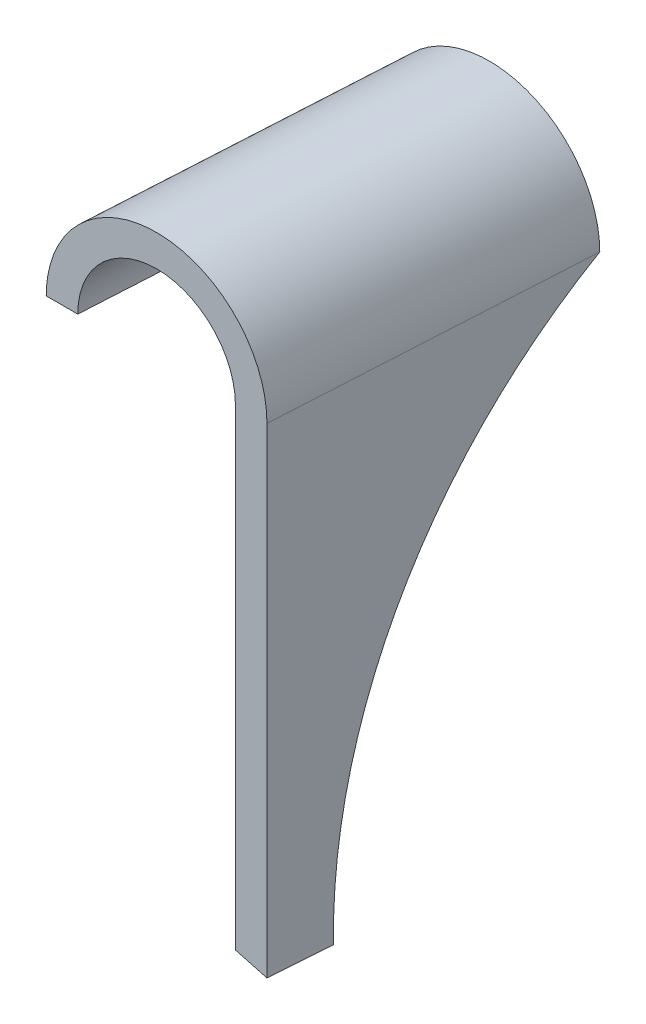
ISO-10303-21;
HEADER;
FILE_DESCRIPTION(('STEP AP214'),'2;1');
FILE_NAME('part.step','',(''),(''),'','','');
FILE_SCHEMA(('AUTOMOTIVE_DESIGN { 1 0 10303 214 1 1 1 1 }'));
ENDSEC;
DATA;
#1=APPLICATION_CONTEXT('core data for automotive mechanical design processes');
#2=APPLICATION_PROTOCOL_DEFINITION('international standard','automotive_design',2000,#1);
#3=PRODUCT_CONTEXT('',#1,'mechanical');
#4=PRODUCT('Part','Part','',(#3));
#5=PRODUCT_RELATED_PRODUCT_CATEGORY('part','',(#4));
#6=PRODUCT_DEFINITION_FORMATION('','',#4);
#7=PRODUCT_DEFINITION_CONTEXT('part definition',#1,'design');
#8=PRODUCT_DEFINITION('design','',#6,#7);
#9=PRODUCT_DEFINITION_SHAPE('','',#8);
#10=(LENGTH_UNIT() NAMED_UNIT(*) SI_UNIT(.MILLI.,.METRE.));
#11=(NAMED_UNIT(*) PLANE_ANGLE_UNIT() SI_UNIT($,.RADIAN.));
#12=(NAMED_UNIT(*) SI_UNIT($,.STERADIAN.) SOLID_ANGLE_UNIT());
#13=UNCERTAINTY_MEASURE_WITH_UNIT(LENGTH_MEASURE(1.E-05),#10,'distance_accuracy_value','');
#14=(GEOMETRIC_REPRESENTATION_CONTEXT(3) GLOBAL_UNCERTAINTY_ASSIGNED_CONTEXT((#13)) GLOBAL_UNIT_ASSIGNED_CONTEXT((#10,
#11,#12)) REPRESENTATION_CONTEXT('',''));
#15=CARTESIAN_POINT('',(0.,0.,0.));
#16=DIRECTION('',(0.,0.,1.));
#17=DIRECTION('',(1.,0.,0.));
#18=AXIS2_PLACEMENT_3D('',#15,#16,#17);
#19=CARTESIAN_POINT('',(0.,0.,10.));
#20=DIRECTION('',(0.,0.,1.));
#21=DIRECTION('',(1.,0.,0.));
#22=AXIS2_PLACEMENT_3D('',#19,#20,#21);
#23=PLANE('',#22);
#24=DIRECTION('',(0.,-1.,0.));
#25=VECTOR('',#24,1.);
#26=CARTESIAN_POINT('',(-114.770321228191,0.,10.));
#27=LINE('',#26,#25);
#28=CARTESIAN_POINT('',(-114.770321228191,64.2083159442407,10.));
#29=VERTEX_POINT('',#28);
#30=CARTESIAN_POINT('',(-114.770321228191,-12.0791229983124,10.));
#31=VERTEX_POINT('',#30);
#32=EDGE_CURVE('E139',#29,#31,#27,.T.);
#33=ORIENTED_EDGE('',*,*,#32,.F.);
#34=CARTESIAN_POINT('',(-132.298860842031,64.2083159442407,10.));
#35=DIRECTION('',(0.,0.,1.));
#36=DIRECTION('',(-1.,0.,0.));
#37=AXIS2_PLACEMENT_3D('',#34,#35,#36);
#38=ELLIPSE('',#37,17.5285396138397,17.5);
#39=CARTESIAN_POINT('',(-149.827400455871,64.2083159442407,9.99999999999999));
#40=VERTEX_POINT('',#39);
#41=EDGE_CURVE('E149',#29,#40,#38,.T.);
#42=ORIENTED_EDGE('',*,*,#41,.T.);
#43=DIRECTION('',(1.,0.,0.));
#44=VECTOR('',#43,1.);
#45=CARTESIAN_POINT('',(-165.74301662356,64.2083159442407,10.));
#46=LINE('',#45,#44);
#47=CARTESIAN_POINT('',(-144.819246280488,64.2083159442407,9.99999999999999));
#48=VERTEX_POINT('',#47);
#49=EDGE_CURVE('E155',#40,#48,#46,.T.);
#50=ORIENTED_EDGE('',*,*,#49,.T.);
#51=CARTESIAN_POINT('',(-132.298860842031,64.2083159442407,10.));
#52=DIRECTION('',(0.,0.,1.));
#53=DIRECTION('',(-1.,0.,0.));
#54=AXIS2_PLACEMENT_3D('',#51,#52,#53);
#55=ELLIPSE('',#54,12.5203854384569,12.5);
#56=CARTESIAN_POINT('',(-119.778475403574,64.2083159442407,9.99999999999976));
#57=VERTEX_POINT('',#56);
#58=EDGE_CURVE('E144',#57,#48,#55,.T.);
#59=ORIENTED_EDGE('',*,*,#58,.F.);
#60=DIRECTION('',(0.,1.,0.));
#61=VECTOR('',#60,1.);
#62=CARTESIAN_POINT('',(-119.778475403574,0.,10.));
#63=LINE('',#62,#61);
#64=CARTESIAN_POINT('',(-119.778475403574,-10.737192131448,9.99999999999976));
#65=VERTEX_POINT('',#64);
#66=EDGE_CURVE('E162',#65,#57,#63,.T.);
#67=ORIENTED_EDGE('',*,*,#66,.F.);
#68=DIRECTION('',(-0.965925826289068,0.258819045102521,0.));
#69=VECTOR('',#68,1.);
#70=CARTESIAN_POINT('',(-10.7079344716167,-39.9625554921918,10.));
#71=LINE('',#70,#69);
#72=EDGE_CURVE('E93',#31,#65,#71,.T.);
#73=ORIENTED_EDGE('',*,*,#72,.F.);
#74=EDGE_LOOP('',(#33,#42,#50,#59,#67,#73));
#75=FACE_BOUND('',#74,.T.);
#76=ADVANCED_FACE('F85',(#75),#23,.T.);
#77=CARTESIAN_POINT('',(-165.74301662356,64.2083159442407,-40.));
#78=DIRECTION('',(0.,-1.,0.));
#79=DIRECTION('',(0.,0.,-1.));
#80=AXIS2_PLACEMENT_3D('',#77,#78,#79);
#81=PLANE('',#80);
#82=DIRECTION('',(-0.0570412885398924,0.,0.99837182021615));
#83=VECTOR('',#82,1.);
#84=CARTESIAN_POINT('',(-141.500625900315,64.2083159442407,-48.0845411169636));
#85=LINE('',#84,#83);
#86=CARTESIAN_POINT('',(-141.962530606785,64.2083159442407,-40.));
#87=VERTEX_POINT('',#86);
#88=EDGE_CURVE('E185',#87,#48,#85,.T.);
#89=ORIENTED_EDGE('',*,*,#88,.T.);
#90=ORIENTED_EDGE('',*,*,#49,.F.);
#91=DIRECTION('',(-0.0570412885398924,0.,0.99837182021615));
#92=VECTOR('',#91,1.);
#93=CARTESIAN_POINT('',(-146.492485001395,64.2083159442407,-48.369747559663));
#94=LINE('',#93,#92);
#95=CARTESIAN_POINT('',(-146.970684782168,64.2083159442407,-40.));
#96=VERTEX_POINT('',#95);
#97=EDGE_CURVE('E104',#96,#40,#94,.T.);
#98=ORIENTED_EDGE('',*,*,#97,.F.);
#99=DIRECTION('',(1.,0.,0.));
#100=VECTOR('',#99,1.);
#101=CARTESIAN_POINT('',(-165.74301662356,64.2083159442407,-40.));
#102=LINE('',#101,#100);
#103=EDGE_CURVE('E157',#96,#87,#102,.T.);
#104=ORIENTED_EDGE('',*,*,#103,.T.);
#105=EDGE_LOOP('',(#89,#90,#98,#104));
#106=FACE_BOUND('',#105,.T.);
#107=ADVANCED_FACE('F205',(#106),#81,.T.);
#108=CARTESIAN_POINT('',(0.,0.,-40.));
#109=DIRECTION('',(0.,0.,1.));
#110=DIRECTION('',(1.,0.,0.));
#111=AXIS2_PLACEMENT_3D('',#108,#109,#110);
#112=PLANE('',#111);
#113=CARTESIAN_POINT('',(-129.442145168328,64.2083159442407,-40.));
#114=DIRECTION('',(0.,0.,1.));
#115=DIRECTION('',(-1.,0.,0.));
#116=AXIS2_PLACEMENT_3D('',#113,#114,#115);
#117=ELLIPSE('',#116,17.5285396138397,17.5);
#118=CARTESIAN_POINT('',(-111.913605554488,64.2083159442407,-40.));
#119=VERTEX_POINT('',#118);
#120=EDGE_CURVE('E12',#119,#96,#117,.T.);
#121=ORIENTED_EDGE('',*,*,#120,.F.);
#122=CARTESIAN_POINT('',(763.265329820694,-10.6773328411647,-40.));
#123=DIRECTION('',(0.,0.,1.));
#124=DIRECTION('',(1.,0.,0.));
#125=AXIS2_PLACEMENT_3D('',#122,#123,#124);
#126=ELLIPSE('',#125,1577.80446942494,90.);
#127=CARTESIAN_POINT('',(-116.921759729871,64.017088464631,-40.));
#128=VERTEX_POINT('',#127);
#129=EDGE_CURVE('E191',#119,#128,#126,.T.);
#130=ORIENTED_EDGE('',*,*,#129,.T.);
#131=DIRECTION('',(0.,1.,0.));
#132=VECTOR('',#131,1.);
#133=CARTESIAN_POINT('',(-116.921759729871,-53.2440936926434,-40.));
#134=LINE('',#133,#132);
#135=CARTESIAN_POINT('',(-116.921759729871,64.2083159442407,-40.));
#136=VERTEX_POINT('',#135);
#137=EDGE_CURVE('E178',#128,#136,#134,.T.);
#138=ORIENTED_EDGE('',*,*,#137,.T.);
#139=CARTESIAN_POINT('',(-129.442145168328,64.2083159442407,-40.));
#140=DIRECTION('',(0.,0.,1.));
#141=DIRECTION('',(-1.,0.,0.));
#142=AXIS2_PLACEMENT_3D('',#139,#140,#141);
#143=ELLIPSE('',#142,12.5203854384569,12.5);
#144=EDGE_CURVE('E182',#136,#87,#143,.T.);
#145=ORIENTED_EDGE('',*,*,#144,.T.);
#146=ORIENTED_EDGE('',*,*,#103,.F.);
#147=EDGE_LOOP('',(#121,#130,#138,#145,#146));
#148=FACE_BOUND('',#147,.T.);
#149=ADVANCED_FACE('F203',(#148),#112,.F.);
#150=CARTESIAN_POINT('',(-10.7079344716167,-39.9625554921918,10.));
#151=DIRECTION('',(-0.258819045102521,-0.965925826289068,0.));
#152=DIRECTION('',(0.965925826289068,-0.258819045102521,0.));
#153=AXIS2_PLACEMENT_3D('',#150,#151,#152);
#154=PLANE('',#153);
#155=DIRECTION('',(0.0570346271199998,-0.0152823822774142,-0.998255227935827));
#156=VECTOR('',#155,1.);
#157=CARTESIAN_POINT('',(-114.407507727297,-12.1763385828802,3.64981429138124));
#158=LINE('',#157,#156);
#159=CARTESIAN_POINT('',(-114.198978093451,-12.2322139298705,0.));
#160=VERTEX_POINT('',#159);
#161=EDGE_CURVE('E152',#31,#160,#158,.T.);
#162=ORIENTED_EDGE('',*,*,#161,.F.);
#163=ORIENTED_EDGE('',*,*,#72,.T.);
#164=DIRECTION('',(-0.0570346271200015,0.0152823822774146,0.998255227935827));
#165=VECTOR('',#164,1.);
#166=CARTESIAN_POINT('',(-119.398200973654,-10.8390863578474,3.34420234010542));
#167=LINE('',#166,#165);
#168=CARTESIAN_POINT('',(-119.191588458902,-10.8944480143213,-0.272057350239968));
#169=VERTEX_POINT('',#168);
#170=EDGE_CURVE('E169',#169,#65,#167,.T.);
#171=ORIENTED_EDGE('',*,*,#170,.F.);
#172=CARTESIAN_POINT('',(-120.001873316217,-10.6773328411647,-90.4648652653761));
#173=DIRECTION('',(-0.258819045102521,-0.965925826289068,0.));
#174=DIRECTION('',(0.964240505891296,-0.25836746486295,0.0590465909159068));
#175=AXIS2_PLACEMENT_3D('',#172,#173,#174);
#176=ELLIPSE('',#175,348.300393122854,90.);
#177=EDGE_CURVE('E194',#160,#169,#176,.T.);
#178=ORIENTED_EDGE('',*,*,#177,.F.);
#179=EDGE_LOOP('',(#162,#163,#171,#178));
#180=FACE_BOUND('',#179,.T.);
#181=ADVANCED_FACE('F87',(#180),#154,.T.);
#182=CARTESIAN_POINT('',(-129.020978147613,64.2083159442407,-47.3715250102149));
#183=DIRECTION('',(-0.0570412885398924,0.,0.99837182021615));
#184=DIRECTION('',(0.99837182021615,0.,0.0570412885398924));
#185=AXIS2_PLACEMENT_3D('',#182,#183,#184);
#186=CYLINDRICAL_SURFACE('',#185,17.5);
#187=DIRECTION('',(-0.0570412885398924,0.,0.99837182021615));
#188=VECTOR('',#187,1.);
#189=CARTESIAN_POINT('',(-111.54947129383,64.2083159442407,-46.3733024607668));
#190=LINE('',#189,#188);
#191=EDGE_CURVE('E99',#119,#29,#190,.T.);
#192=ORIENTED_EDGE('',*,*,#191,.F.);
#193=ORIENTED_EDGE('',*,*,#120,.T.);
#194=ORIENTED_EDGE('',*,*,#97,.T.);
#195=ORIENTED_EDGE('',*,*,#41,.F.);
#196=EDGE_LOOP('',(#192,#193,#194,#195));
#197=FACE_BOUND('',#196,.T.);
#198=ADVANCED_FACE('F154',(#197),#186,.T.);
#199=CARTESIAN_POINT('',(-129.020978147613,64.2083159442407,-47.3715250102149));
#200=DIRECTION('',(-0.0570412885398924,0.,0.99837182021615));
#201=DIRECTION('',(0.99837182021615,0.,0.0570412885398924));
#202=AXIS2_PLACEMENT_3D('',#199,#200,#201);
#203=CYLINDRICAL_SURFACE('',#202,12.5);
#204=ORIENTED_EDGE('',*,*,#58,.T.);
#205=ORIENTED_EDGE('',*,*,#88,.F.);
#206=ORIENTED_EDGE('',*,*,#144,.F.);
#207=DIRECTION('',(-0.0570412885398924,0.,0.99837182021615));
#208=VECTOR('',#207,1.);
#209=CARTESIAN_POINT('',(-116.541330394911,64.2083159442407,-46.6585089034663));
#210=LINE('',#209,#208);
#211=EDGE_CURVE('E177',#136,#57,#210,.T.);
#212=ORIENTED_EDGE('',*,*,#211,.T.);
#213=EDGE_LOOP('',(#204,#205,#206,#212));
#214=FACE_BOUND('',#213,.T.);
#215=ADVANCED_FACE('F207',(#214),#203,.F.);
#216=CARTESIAN_POINT('',(-119.207132268833,-38.8125,0.));
#217=DIRECTION('',(0.99837182021615,0.,0.0570412885398942));
#218=DIRECTION('',(0.0570412885398942,0.,-0.99837182021615));
#219=AXIS2_PLACEMENT_3D('',#216,#217,#218);
#220=PLANE('',#219);
#221=ORIENTED_EDGE('',*,*,#137,.F.);
#222=CARTESIAN_POINT('',(-114.057887428495,-10.6773328411647,-90.1252597123817));
#223=DIRECTION('',(0.99837182021615,0.,0.0570412885398942));
#224=DIRECTION('',(0.0570412885398942,0.,-0.99837182021615));
#225=AXIS2_PLACEMENT_3D('',#222,#223,#224);
#226=CIRCLE('',#225,90.);
#227=EDGE_CURVE('E176',#128,#169,#226,.T.);
#228=ORIENTED_EDGE('',*,*,#227,.T.);
#229=ORIENTED_EDGE('',*,*,#170,.T.);
#230=ORIENTED_EDGE('',*,*,#66,.T.);
#231=ORIENTED_EDGE('',*,*,#211,.F.);
#232=EDGE_LOOP('',(#221,#228,#229,#230,#231));
#233=FACE_BOUND('',#232,.T.);
#234=ADVANCED_FACE('F173',(#233),#220,.F.);
#235=CARTESIAN_POINT('',(-111.913605554488,-53.2440936926434,-40.));
#236=DIRECTION('',(-0.99837182021615,0.,-0.0570412885398925));
#237=DIRECTION('',(-0.0570412885398925,0.,0.99837182021615));
#238=AXIS2_PLACEMENT_3D('',#235,#236,#237);
#239=PLANE('',#238);
#240=CARTESIAN_POINT('',(-109.066028327415,-10.6773328411647,-89.8400532696823));
#241=DIRECTION('',(0.99837182021615,0.,0.0570412885398925));
#242=DIRECTION('',(0.0570412885398925,0.,-0.99837182021615));
#243=AXIS2_PLACEMENT_3D('',#240,#241,#242);
#244=CIRCLE('',#243,90.);
#245=EDGE_CURVE('E142',#119,#160,#244,.T.);
#246=ORIENTED_EDGE('',*,*,#245,.F.);
#247=ORIENTED_EDGE('',*,*,#191,.T.);
#248=ORIENTED_EDGE('',*,*,#32,.T.);
#249=ORIENTED_EDGE('',*,*,#161,.T.);
#250=EDGE_LOOP('',(#246,#247,#248,#249));
#251=FACE_BOUND('',#250,.T.);
#252=ADVANCED_FACE('F138',(#251),#239,.F.);
#253=CARTESIAN_POINT('',(-158.984619338222,-10.6773328411647,-92.6921176966769));
#254=DIRECTION('',(0.99837182021615,0.,0.0570412885398925));
#255=DIRECTION('',(0.0570412885398925,0.,-0.99837182021615));
#256=AXIS2_PLACEMENT_3D('',#253,#254,#255);
#257=CYLINDRICAL_SURFACE('',#256,90.);
#258=ORIENTED_EDGE('',*,*,#129,.F.);
#259=ORIENTED_EDGE('',*,*,#245,.T.);
#260=ORIENTED_EDGE('',*,*,#177,.T.);
#261=ORIENTED_EDGE('',*,*,#227,.F.);
#262=EDGE_LOOP('',(#258,#259,#260,#261));
#263=FACE_BOUND('',#262,.T.);
#264=ADVANCED_FACE('F199',(#263),#257,.F.);
#265=CLOSED_SHELL('',(#76,#107,#149,#181,#198,#215,#234,#252,#264));
#266=MANIFOLD_SOLID_BREP('B2',#265);
#267=ADVANCED_BREP_SHAPE_REPRESENTATION('',(#18,#266),#14);
#268=SHAPE_DEFINITION_REPRESENTATION(#9,#267);
ENDSEC;
END-ISO-10303-21;
